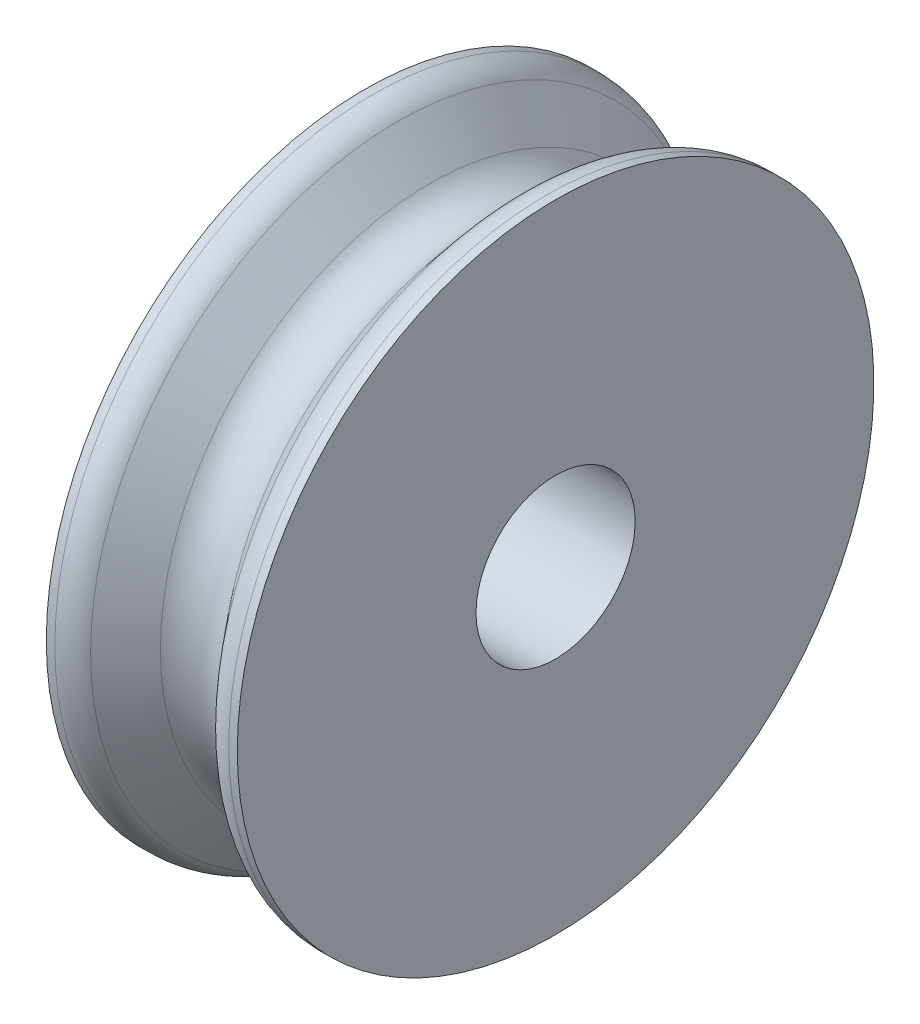
ISO-10303-21;
HEADER;
FILE_DESCRIPTION(('STEP AP214'),'2;1');
FILE_NAME('part.step','',(''),(''),'','','');
FILE_SCHEMA(('AUTOMOTIVE_DESIGN { 1 0 10303 214 1 1 1 1 }'));
ENDSEC;
DATA;
#1=APPLICATION_CONTEXT('core data for automotive mechanical design processes');
#2=APPLICATION_PROTOCOL_DEFINITION('international standard','automotive_design',2000,#1);
#3=PRODUCT_CONTEXT('',#1,'mechanical');
#4=PRODUCT('Part','Part','',(#3));
#5=PRODUCT_RELATED_PRODUCT_CATEGORY('part','',(#4));
#6=PRODUCT_DEFINITION_FORMATION('','',#4);
#7=PRODUCT_DEFINITION_CONTEXT('part definition',#1,'design');
#8=PRODUCT_DEFINITION('design','',#6,#7);
#9=PRODUCT_DEFINITION_SHAPE('','',#8);
#10=(LENGTH_UNIT() NAMED_UNIT(*) SI_UNIT(.MILLI.,.METRE.));
#11=(NAMED_UNIT(*) PLANE_ANGLE_UNIT() SI_UNIT($,.RADIAN.));
#12=(NAMED_UNIT(*) SI_UNIT($,.STERADIAN.) SOLID_ANGLE_UNIT());
#13=UNCERTAINTY_MEASURE_WITH_UNIT(LENGTH_MEASURE(1.E-05),#10,'distance_accuracy_value','');
#14=(GEOMETRIC_REPRESENTATION_CONTEXT(3) GLOBAL_UNCERTAINTY_ASSIGNED_CONTEXT((#13)) GLOBAL_UNIT_ASSIGNED_CONTEXT((#10,
#11,#12)) REPRESENTATION_CONTEXT('',''));
#15=CARTESIAN_POINT('',(0.,0.,0.));
#16=DIRECTION('',(0.,0.,1.));
#17=DIRECTION('',(1.,0.,0.));
#18=AXIS2_PLACEMENT_3D('',#15,#16,#17);
#19=CARTESIAN_POINT('',(0.,0.,0.));
#20=DIRECTION('',(-1.,0.,0.));
#21=DIRECTION('',(0.,0.,1.));
#22=AXIS2_PLACEMENT_3D('',#19,#20,#21);
#23=TOROIDAL_SURFACE('',#22,46.3,6.3);
#24=CARTESIAN_POINT('',(-4.82607999164955,0.,0.));
#25=DIRECTION('',(-1.,0.,0.));
#26=DIRECTION('',(0.,0.,1.));
#27=AXIS2_PLACEMENT_3D('',#24,#25,#26);
#28=CIRCLE('',#27,42.2504380589748);
#29=CARTESIAN_POINT('',(-4.82607999164955,0.,42.2504380589748));
#30=VERTEX_POINT('',#29);
#31=EDGE_CURVE('E52',#30,#30,#28,.T.);
#32=ORIENTED_EDGE('',*,*,#31,.F.);
#33=EDGE_LOOP('',(#32));
#34=FACE_BOUND('',#33,.T.);
#35=CARTESIAN_POINT('',(4.82607999164955,0.,0.));
#36=DIRECTION('',(-1.,0.,0.));
#37=DIRECTION('',(0.,0.,1.));
#38=AXIS2_PLACEMENT_3D('',#35,#36,#37);
#39=CIRCLE('',#38,42.2504380589748);
#40=CARTESIAN_POINT('',(4.82607999164955,0.,42.2504380589748));
#41=VERTEX_POINT('',#40);
#42=EDGE_CURVE('E61',#41,#41,#39,.T.);
#43=ORIENTED_EDGE('',*,*,#42,.T.);
#44=EDGE_LOOP('',(#43));
#45=FACE_BOUND('',#44,.T.);
#46=ADVANCED_FACE('F32',(#34,#45),#23,.F.);
#47=CARTESIAN_POINT('',(-4.82607999164955,0.,0.));
#48=DIRECTION('',(-1.,0.,0.));
#49=DIRECTION('',(0.,0.,1.));
#50=AXIS2_PLACEMENT_3D('',#47,#48,#49);
#51=CONICAL_SURFACE('',#50,42.2504380589748,0.872664625997163);
#52=CARTESIAN_POINT('',(-9.83005063332941,0.,0.));
#53=DIRECTION('',(1.,0.,0.));
#54=DIRECTION('',(0.,0.,-1.));
#55=AXIS2_PLACEMENT_3D('',#52,#53,#54);
#56=CIRCLE('',#55,48.2139380484327);
#57=CARTESIAN_POINT('',(-9.83005063332941,0.,-48.2139380484327));
#58=VERTEX_POINT('',#57);
#59=EDGE_CURVE('E10',#58,#58,#56,.T.);
#60=ORIENTED_EDGE('',*,*,#59,.T.);
#61=EDGE_LOOP('',(#60));
#62=FACE_BOUND('',#61,.T.);
#63=ORIENTED_EDGE('',*,*,#31,.T.);
#64=EDGE_LOOP('',(#63));
#65=FACE_BOUND('',#64,.T.);
#66=ADVANCED_FACE('F91',(#62,#65),#51,.T.);
#67=CARTESIAN_POINT('',(-75.888260409414,0.,0.));
#68=DIRECTION('',(-1.,0.,0.));
#69=DIRECTION('',(0.,0.,1.));
#70=AXIS2_PLACEMENT_3D('',#67,#68,#69);
#71=CYLINDRICAL_SURFACE('',#70,50.);
#72=CARTESIAN_POINT('',(-13.6602728489243,0.,0.));
#73=DIRECTION('',(1.,0.,0.));
#74=DIRECTION('',(0.,0.,-1.));
#75=AXIS2_PLACEMENT_3D('',#72,#73,#74);
#76=CIRCLE('',#75,50.);
#77=CARTESIAN_POINT('',(-13.6602728489243,0.,-50.));
#78=VERTEX_POINT('',#77);
#79=EDGE_CURVE('E39',#78,#78,#76,.F.);
#80=ORIENTED_EDGE('',*,*,#79,.T.);
#81=EDGE_LOOP('',(#80));
#82=FACE_BOUND('',#81,.T.);
#83=CARTESIAN_POINT('',(-15.,0.,0.));
#84=DIRECTION('',(-1.,0.,0.));
#85=DIRECTION('',(0.,0.,1.));
#86=AXIS2_PLACEMENT_3D('',#83,#84,#85);
#87=CIRCLE('',#86,50.);
#88=CARTESIAN_POINT('',(-15.,0.,50.));
#89=VERTEX_POINT('',#88);
#90=EDGE_CURVE('E55',#89,#89,#87,.T.);
#91=ORIENTED_EDGE('',*,*,#90,.F.);
#92=EDGE_LOOP('',(#91));
#93=FACE_BOUND('',#92,.T.);
#94=ADVANCED_FACE('F87',(#82,#93),#71,.T.);
#95=CARTESIAN_POINT('',(-15.,50.,0.));
#96=DIRECTION('',(1.,0.,0.));
#97=DIRECTION('',(0.,0.,-1.));
#98=AXIS2_PLACEMENT_3D('',#95,#96,#97);
#99=PLANE('',#98);
#100=CARTESIAN_POINT('',(-15.,0.,0.));
#101=DIRECTION('',(-1.,0.,0.));
#102=DIRECTION('',(0.,0.,1.));
#103=AXIS2_PLACEMENT_3D('',#100,#101,#102);
#104=CIRCLE('',#103,12.5);
#105=CARTESIAN_POINT('',(-15.,0.,12.5));
#106=VERTEX_POINT('',#105);
#107=EDGE_CURVE('E58',#106,#106,#104,.T.);
#108=ORIENTED_EDGE('',*,*,#107,.F.);
#109=EDGE_LOOP('',(#108));
#110=FACE_BOUND('',#109,.T.);
#111=ORIENTED_EDGE('',*,*,#90,.T.);
#112=EDGE_LOOP('',(#111));
#113=FACE_BOUND('',#112,.T.);
#114=ADVANCED_FACE('F77',(#110,#113),#99,.F.);
#115=CARTESIAN_POINT('',(-75.888260409414,0.,0.));
#116=DIRECTION('',(-1.,0.,0.));
#117=DIRECTION('',(0.,0.,1.));
#118=AXIS2_PLACEMENT_3D('',#115,#116,#117);
#119=CYLINDRICAL_SURFACE('',#118,12.5);
#120=ORIENTED_EDGE('',*,*,#107,.T.);
#121=EDGE_LOOP('',(#120));
#122=FACE_BOUND('',#121,.T.);
#123=CARTESIAN_POINT('',(15.,0.,0.));
#124=DIRECTION('',(-1.,0.,0.));
#125=DIRECTION('',(0.,0.,1.));
#126=AXIS2_PLACEMENT_3D('',#123,#124,#125);
#127=CIRCLE('',#126,12.5);
#128=CARTESIAN_POINT('',(15.,0.,12.5));
#129=VERTEX_POINT('',#128);
#130=EDGE_CURVE('E67',#129,#129,#127,.T.);
#131=ORIENTED_EDGE('',*,*,#130,.F.);
#132=EDGE_LOOP('',(#131));
#133=FACE_BOUND('',#132,.T.);
#134=ADVANCED_FACE('F74',(#122,#133),#119,.F.);
#135=CARTESIAN_POINT('',(4.82607999164955,0.,0.));
#136=DIRECTION('',(1.,0.,0.));
#137=DIRECTION('',(0.,0.,1.));
#138=AXIS2_PLACEMENT_3D('',#135,#136,#137);
#139=CONICAL_SURFACE('',#138,42.2504380589748,0.872664625997163);
#140=CARTESIAN_POINT('',(9.83005063332941,0.,0.));
#141=DIRECTION('',(-1.,0.,0.));
#142=DIRECTION('',(0.,0.,1.));
#143=AXIS2_PLACEMENT_3D('',#140,#141,#142);
#144=CIRCLE('',#143,48.2139380484327);
#145=CARTESIAN_POINT('',(9.83005063332941,0.,48.2139380484327));
#146=VERTEX_POINT('',#145);
#147=EDGE_CURVE('E47',#146,#146,#144,.T.);
#148=ORIENTED_EDGE('',*,*,#147,.T.);
#149=EDGE_LOOP('',(#148));
#150=FACE_BOUND('',#149,.T.);
#151=ORIENTED_EDGE('',*,*,#42,.F.);
#152=EDGE_LOOP('',(#151));
#153=FACE_BOUND('',#152,.T.);
#154=ADVANCED_FACE('F76',(#150,#153),#139,.T.);
#155=CARTESIAN_POINT('',(75.888260409414,0.,0.));
#156=DIRECTION('',(1.,0.,0.));
#157=DIRECTION('',(0.,0.,1.));
#158=AXIS2_PLACEMENT_3D('',#155,#156,#157);
#159=CYLINDRICAL_SURFACE('',#158,50.);
#160=CARTESIAN_POINT('',(13.6602728489243,0.,0.));
#161=DIRECTION('',(1.,0.,0.));
#162=DIRECTION('',(0.,0.,-1.));
#163=AXIS2_PLACEMENT_3D('',#160,#161,#162);
#164=CIRCLE('',#163,50.);
#165=CARTESIAN_POINT('',(13.6602728489243,0.,-50.));
#166=VERTEX_POINT('',#165);
#167=EDGE_CURVE('E43',#166,#166,#164,.T.);
#168=ORIENTED_EDGE('',*,*,#167,.T.);
#169=EDGE_LOOP('',(#168));
#170=FACE_BOUND('',#169,.T.);
#171=CARTESIAN_POINT('',(15.,0.,0.));
#172=DIRECTION('',(-1.,0.,0.));
#173=DIRECTION('',(0.,0.,1.));
#174=AXIS2_PLACEMENT_3D('',#171,#172,#173);
#175=CIRCLE('',#174,50.);
#176=CARTESIAN_POINT('',(15.,0.,50.));
#177=VERTEX_POINT('',#176);
#178=EDGE_CURVE('E64',#177,#177,#175,.T.);
#179=ORIENTED_EDGE('',*,*,#178,.T.);
#180=EDGE_LOOP('',(#179));
#181=FACE_BOUND('',#180,.T.);
#182=ADVANCED_FACE('F84',(#170,#181),#159,.T.);
#183=CARTESIAN_POINT('',(15.,50.,0.));
#184=DIRECTION('',(-1.,0.,0.));
#185=DIRECTION('',(0.,0.,-1.));
#186=AXIS2_PLACEMENT_3D('',#183,#184,#185);
#187=PLANE('',#186);
#188=ORIENTED_EDGE('',*,*,#130,.T.);
#189=EDGE_LOOP('',(#188));
#190=FACE_BOUND('',#189,.T.);
#191=ORIENTED_EDGE('',*,*,#178,.F.);
#192=EDGE_LOOP('',(#191));
#193=FACE_BOUND('',#192,.T.);
#194=ADVANCED_FACE('F71',(#190,#193),#187,.F.);
#195=CARTESIAN_POINT('',(13.6602728489243,0.,0.));
#196=DIRECTION('',(1.,0.,0.));
#197=DIRECTION('',(0.,0.,-1.));
#198=AXIS2_PLACEMENT_3D('',#195,#196,#197);
#199=TOROIDAL_SURFACE('',#198,45.,5.);
#200=ORIENTED_EDGE('',*,*,#167,.F.);
#201=EDGE_LOOP('',(#200));
#202=FACE_BOUND('',#201,.T.);
#203=ORIENTED_EDGE('',*,*,#147,.F.);
#204=EDGE_LOOP('',(#203));
#205=FACE_BOUND('',#204,.T.);
#206=ADVANCED_FACE('F101',(#202,#205),#199,.T.);
#207=CARTESIAN_POINT('',(-13.6602728489243,0.,0.));
#208=DIRECTION('',(1.,0.,0.));
#209=DIRECTION('',(0.,0.,-1.));
#210=AXIS2_PLACEMENT_3D('',#207,#208,#209);
#211=TOROIDAL_SURFACE('',#210,45.,5.);
#212=ORIENTED_EDGE('',*,*,#59,.F.);
#213=EDGE_LOOP('',(#212));
#214=FACE_BOUND('',#213,.T.);
#215=ORIENTED_EDGE('',*,*,#79,.F.);
#216=EDGE_LOOP('',(#215));
#217=FACE_BOUND('',#216,.T.);
#218=ADVANCED_FACE('F34',(#214,#217),#211,.T.);
#219=CLOSED_SHELL('',(#46,#66,#94,#114,#134,#154,#182,#194,#206,#218));
#220=MANIFOLD_SOLID_BREP('B2',#219);
#221=ADVANCED_BREP_SHAPE_REPRESENTATION('',(#18,#220),#14);
#222=SHAPE_DEFINITION_REPRESENTATION(#9,#221);
ENDSEC;
END-ISO-10303-21;
